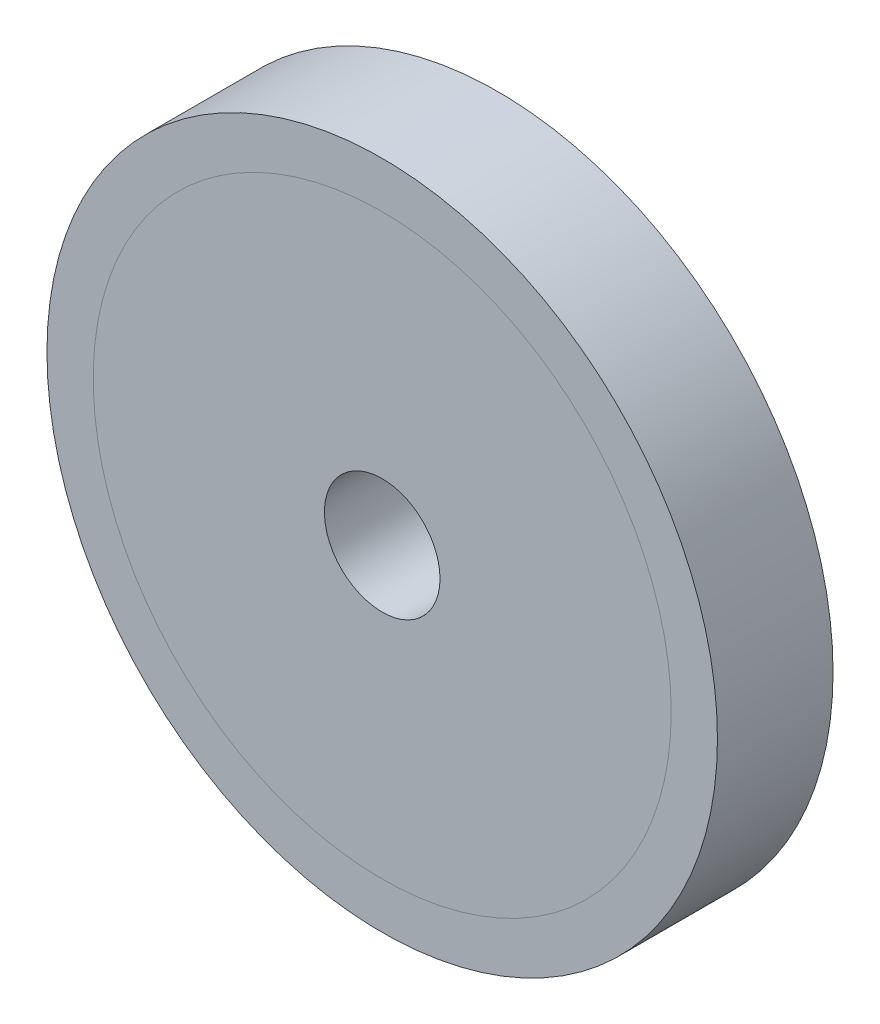
ISO-10303-21;
HEADER;
FILE_DESCRIPTION(('STEP AP214'),'2;1');
FILE_NAME('part.step','',(''),(''),'','','');
FILE_SCHEMA(('AUTOMOTIVE_DESIGN { 1 0 10303 214 1 1 1 1 }'));
ENDSEC;
DATA;
#1=APPLICATION_CONTEXT('core data for automotive mechanical design processes');
#2=APPLICATION_PROTOCOL_DEFINITION('international standard','automotive_design',2000,#1);
#3=PRODUCT_CONTEXT('',#1,'mechanical');
#4=PRODUCT('Part','Part','',(#3));
#5=PRODUCT_RELATED_PRODUCT_CATEGORY('part','',(#4));
#6=PRODUCT_DEFINITION_FORMATION('','',#4);
#7=PRODUCT_DEFINITION_CONTEXT('part definition',#1,'design');
#8=PRODUCT_DEFINITION('design','',#6,#7);
#9=PRODUCT_DEFINITION_SHAPE('','',#8);
#10=(LENGTH_UNIT() NAMED_UNIT(*) SI_UNIT(.MILLI.,.METRE.));
#11=(NAMED_UNIT(*) PLANE_ANGLE_UNIT() SI_UNIT($,.RADIAN.));
#12=(NAMED_UNIT(*) SI_UNIT($,.STERADIAN.) SOLID_ANGLE_UNIT());
#13=UNCERTAINTY_MEASURE_WITH_UNIT(LENGTH_MEASURE(1.E-05),#10,'distance_accuracy_value','');
#14=(GEOMETRIC_REPRESENTATION_CONTEXT(3) GLOBAL_UNCERTAINTY_ASSIGNED_CONTEXT((#13)) GLOBAL_UNIT_ASSIGNED_CONTEXT((#10,
#11,#12)) REPRESENTATION_CONTEXT('',''));
#15=CARTESIAN_POINT('',(0.,0.,0.));
#16=DIRECTION('',(0.,0.,1.));
#17=DIRECTION('',(1.,0.,0.));
#18=AXIS2_PLACEMENT_3D('',#15,#16,#17);
#19=CARTESIAN_POINT('',(0.,0.,2.));
#20=DIRECTION('',(0.,0.,-1.));
#21=DIRECTION('',(-1.,0.,0.));
#22=AXIS2_PLACEMENT_3D('',#19,#20,#21);
#23=CYLINDRICAL_SURFACE('',#22,5.);
#24=CARTESIAN_POINT('',(0.,0.,2.));
#25=DIRECTION('',(0.,0.,1.));
#26=DIRECTION('',(1.,0.,0.));
#27=AXIS2_PLACEMENT_3D('',#24,#25,#26);
#28=CIRCLE('',#27,5.);
#29=CARTESIAN_POINT('',(5.,0.,2.));
#30=VERTEX_POINT('',#29);
#31=EDGE_CURVE('E11',#30,#30,#28,.T.);
#32=ORIENTED_EDGE('',*,*,#31,.F.);
#33=EDGE_LOOP('',(#32));
#34=FACE_BOUND('',#33,.T.);
#35=CARTESIAN_POINT('',(0.,0.,0.));
#36=DIRECTION('',(0.,0.,1.));
#37=DIRECTION('',(1.,0.,0.));
#38=AXIS2_PLACEMENT_3D('',#35,#36,#37);
#39=CIRCLE('',#38,5.);
#40=CARTESIAN_POINT('',(5.,0.,0.));
#41=VERTEX_POINT('',#40);
#42=EDGE_CURVE('E49',#41,#41,#39,.T.);
#43=ORIENTED_EDGE('',*,*,#42,.T.);
#44=EDGE_LOOP('',(#43));
#45=FACE_BOUND('',#44,.T.);
#46=ADVANCED_FACE('F46',(#34,#45),#23,.T.);
#47=CARTESIAN_POINT('',(0.,0.,2.));
#48=DIRECTION('',(0.,0.,1.));
#49=DIRECTION('',(1.,0.,0.));
#50=AXIS2_PLACEMENT_3D('',#47,#48,#49);
#51=PLANE('',#50);
#52=CARTESIAN_POINT('',(0.,0.,2.));
#53=DIRECTION('',(0.,0.,1.));
#54=DIRECTION('',(1.,0.,0.));
#55=AXIS2_PLACEMENT_3D('',#52,#53,#54);
#56=CIRCLE('',#55,1.);
#57=CARTESIAN_POINT('',(1.,0.,2.));
#58=VERTEX_POINT('',#57);
#59=EDGE_CURVE('E58',#58,#58,#56,.T.);
#60=ORIENTED_EDGE('',*,*,#59,.F.);
#61=EDGE_LOOP('',(#60));
#62=FACE_BOUND('',#61,.T.);
#63=ORIENTED_EDGE('',*,*,#31,.T.);
#64=EDGE_LOOP('',(#63));
#65=FACE_BOUND('',#64,.T.);
#66=ADVANCED_FACE('F73',(#62,#65),#51,.T.);
#67=CARTESIAN_POINT('',(0.,0.,0.));
#68=DIRECTION('',(0.,0.,1.));
#69=DIRECTION('',(1.,0.,0.));
#70=AXIS2_PLACEMENT_3D('',#67,#68,#69);
#71=PLANE('',#70);
#72=CARTESIAN_POINT('',(0.,0.,0.));
#73=DIRECTION('',(0.,0.,1.));
#74=DIRECTION('',(1.,0.,0.));
#75=AXIS2_PLACEMENT_3D('',#72,#73,#74);
#76=CIRCLE('',#75,1.);
#77=CARTESIAN_POINT('',(1.,0.,0.));
#78=VERTEX_POINT('',#77);
#79=EDGE_CURVE('E56',#78,#78,#76,.T.);
#80=ORIENTED_EDGE('',*,*,#79,.T.);
#81=EDGE_LOOP('',(#80));
#82=FACE_BOUND('',#81,.T.);
#83=ORIENTED_EDGE('',*,*,#42,.F.);
#84=EDGE_LOOP('',(#83));
#85=FACE_BOUND('',#84,.T.);
#86=ADVANCED_FACE('F64',(#82,#85),#71,.F.);
#87=CARTESIAN_POINT('',(0.,0.,0.));
#88=DIRECTION('',(0.,0.,1.));
#89=DIRECTION('',(1.,0.,0.));
#90=AXIS2_PLACEMENT_3D('',#87,#88,#89);
#91=CYLINDRICAL_SURFACE('',#90,1.);
#92=ORIENTED_EDGE('',*,*,#79,.F.);
#93=EDGE_LOOP('',(#92));
#94=FACE_BOUND('',#93,.T.);
#95=ORIENTED_EDGE('',*,*,#59,.T.);
#96=EDGE_LOOP('',(#95));
#97=FACE_BOUND('',#96,.T.);
#98=ADVANCED_FACE('F67',(#94,#97),#91,.F.);
#99=CLOSED_SHELL('',(#46,#66,#86,#98));
#100=MANIFOLD_SOLID_BREP('B2',#99);
#101=CARTESIAN_POINT('',(0.,0.,2.));
#102=DIRECTION('',(0.,0.,1.));
#103=DIRECTION('',(1.,0.,0.));
#104=AXIS2_PLACEMENT_3D('',#101,#102,#103);
#105=PLANE('',#104);
#106=CARTESIAN_POINT('',(0.,0.,2.));
#107=DIRECTION('',(0.,0.,1.));
#108=DIRECTION('',(1.,0.,0.));
#109=AXIS2_PLACEMENT_3D('',#106,#107,#108);
#110=CIRCLE('',#109,5.8);
#111=CARTESIAN_POINT('',(5.8,0.,2.));
#112=VERTEX_POINT('',#111);
#113=EDGE_CURVE('E45',#112,#112,#110,.T.);
#114=ORIENTED_EDGE('',*,*,#113,.T.);
#115=EDGE_LOOP('',(#114));
#116=FACE_BOUND('',#115,.T.);
#117=CARTESIAN_POINT('',(0.,0.,2.));
#118=DIRECTION('',(0.,0.,1.));
#119=DIRECTION('',(1.,0.,0.));
#120=AXIS2_PLACEMENT_3D('',#117,#118,#119);
#121=CIRCLE('',#120,5.);
#122=CARTESIAN_POINT('',(5.,0.,2.));
#123=VERTEX_POINT('',#122);
#124=EDGE_CURVE('E123',#123,#123,#121,.T.);
#125=ORIENTED_EDGE('',*,*,#124,.F.);
#126=EDGE_LOOP('',(#125));
#127=FACE_BOUND('',#126,.T.);
#128=ADVANCED_FACE('F112',(#116,#127),#105,.T.);
#129=CARTESIAN_POINT('',(0.,0.,0.));
#130=DIRECTION('',(0.,0.,1.));
#131=DIRECTION('',(1.,0.,0.));
#132=AXIS2_PLACEMENT_3D('',#129,#130,#131);
#133=PLANE('',#132);
#134=CARTESIAN_POINT('',(0.,0.,0.));
#135=DIRECTION('',(0.,0.,1.));
#136=DIRECTION('',(1.,0.,0.));
#137=AXIS2_PLACEMENT_3D('',#134,#135,#136);
#138=CIRCLE('',#137,5.8);
#139=CARTESIAN_POINT('',(5.8,0.,0.));
#140=VERTEX_POINT('',#139);
#141=EDGE_CURVE('E116',#140,#140,#138,.T.);
#142=ORIENTED_EDGE('',*,*,#141,.F.);
#143=EDGE_LOOP('',(#142));
#144=FACE_BOUND('',#143,.T.);
#145=CARTESIAN_POINT('',(0.,0.,0.));
#146=DIRECTION('',(0.,0.,1.));
#147=DIRECTION('',(1.,0.,0.));
#148=AXIS2_PLACEMENT_3D('',#145,#146,#147);
#149=CIRCLE('',#148,5.);
#150=CARTESIAN_POINT('',(5.,0.,0.));
#151=VERTEX_POINT('',#150);
#152=EDGE_CURVE('E125',#151,#151,#149,.T.);
#153=ORIENTED_EDGE('',*,*,#152,.T.);
#154=EDGE_LOOP('',(#153));
#155=FACE_BOUND('',#154,.T.);
#156=ADVANCED_FACE('F135',(#144,#155),#133,.F.);
#157=CARTESIAN_POINT('',(0.,0.,2.));
#158=DIRECTION('',(0.,0.,-1.));
#159=DIRECTION('',(-1.,0.,0.));
#160=AXIS2_PLACEMENT_3D('',#157,#158,#159);
#161=CYLINDRICAL_SURFACE('',#160,5.8);
#162=ORIENTED_EDGE('',*,*,#113,.F.);
#163=EDGE_LOOP('',(#162));
#164=FACE_BOUND('',#163,.T.);
#165=ORIENTED_EDGE('',*,*,#141,.T.);
#166=EDGE_LOOP('',(#165));
#167=FACE_BOUND('',#166,.T.);
#168=ADVANCED_FACE('F114',(#164,#167),#161,.T.);
#169=CARTESIAN_POINT('',(0.,0.,2.));
#170=DIRECTION('',(0.,0.,-1.));
#171=DIRECTION('',(-1.,0.,0.));
#172=AXIS2_PLACEMENT_3D('',#169,#170,#171);
#173=CYLINDRICAL_SURFACE('',#172,5.);
#174=ORIENTED_EDGE('',*,*,#124,.T.);
#175=EDGE_LOOP('',(#174));
#176=FACE_BOUND('',#175,.T.);
#177=ORIENTED_EDGE('',*,*,#152,.F.);
#178=EDGE_LOOP('',(#177));
#179=FACE_BOUND('',#178,.T.);
#180=ADVANCED_FACE('F131',(#176,#179),#173,.F.);
#181=CLOSED_SHELL('',(#128,#156,#168,#180));
#182=MANIFOLD_SOLID_BREP('B6',#181);
#183=ADVANCED_BREP_SHAPE_REPRESENTATION('',(#18,#100,#182),#14);
#184=SHAPE_DEFINITION_REPRESENTATION(#9,#183);
ENDSEC;
END-ISO-10303-21;
